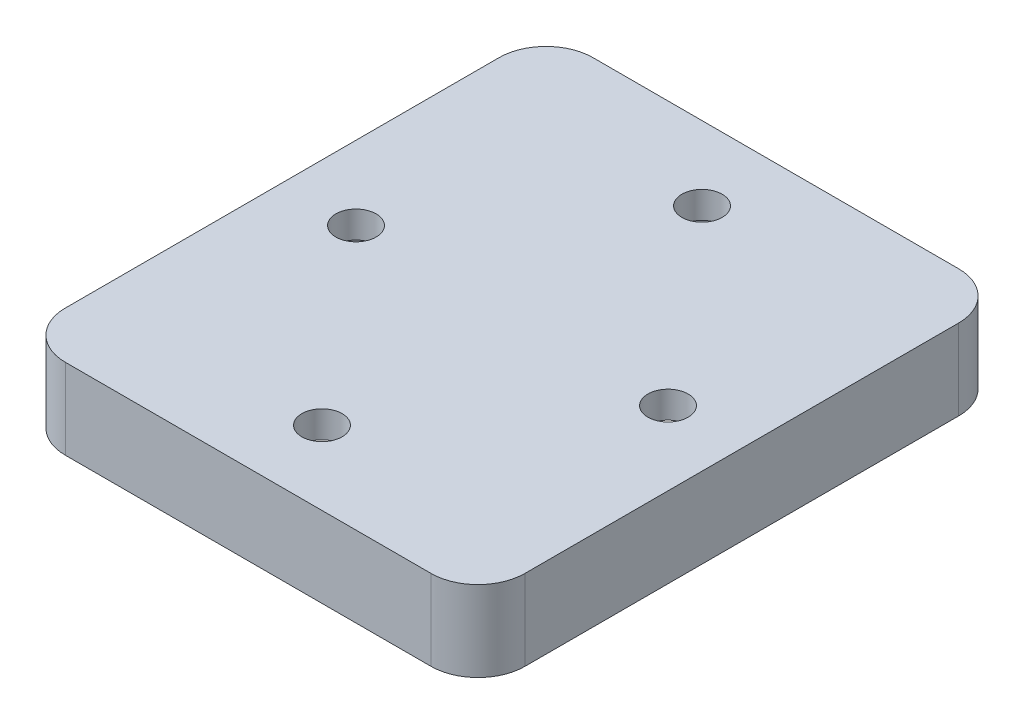
ISO-10303-21;
HEADER;
FILE_DESCRIPTION(('STEP AP214'),'2;1');
FILE_NAME('part.step','',(''),(''),'','','');
FILE_SCHEMA(('AUTOMOTIVE_DESIGN { 1 0 10303 214 1 1 1 1 }'));
ENDSEC;
DATA;
#1=APPLICATION_CONTEXT('core data for automotive mechanical design processes');
#2=APPLICATION_PROTOCOL_DEFINITION('international standard','automotive_design',2000,#1);
#3=PRODUCT_CONTEXT('',#1,'mechanical');
#4=PRODUCT('Part','Part','',(#3));
#5=PRODUCT_RELATED_PRODUCT_CATEGORY('part','',(#4));
#6=PRODUCT_DEFINITION_FORMATION('','',#4);
#7=PRODUCT_DEFINITION_CONTEXT('part definition',#1,'design');
#8=PRODUCT_DEFINITION('design','',#6,#7);
#9=PRODUCT_DEFINITION_SHAPE('','',#8);
#10=(LENGTH_UNIT() NAMED_UNIT(*) SI_UNIT(.MILLI.,.METRE.));
#11=(NAMED_UNIT(*) PLANE_ANGLE_UNIT() SI_UNIT($,.RADIAN.));
#12=(NAMED_UNIT(*) SI_UNIT($,.STERADIAN.) SOLID_ANGLE_UNIT());
#13=UNCERTAINTY_MEASURE_WITH_UNIT(LENGTH_MEASURE(1.E-05),#10,'distance_accuracy_value','');
#14=(GEOMETRIC_REPRESENTATION_CONTEXT(3) GLOBAL_UNCERTAINTY_ASSIGNED_CONTEXT((#13)) GLOBAL_UNIT_ASSIGNED_CONTEXT((#10,
#11,#12)) REPRESENTATION_CONTEXT('',''));
#15=CARTESIAN_POINT('',(0.,0.,0.));
#16=DIRECTION('',(0.,0.,1.));
#17=DIRECTION('',(1.,0.,0.));
#18=AXIS2_PLACEMENT_3D('',#15,#16,#17);
#19=CARTESIAN_POINT('',(-0.273367395030532,2.,-14.0233163024847));
#20=DIRECTION('',(0.,-1.,0.));
#21=DIRECTION('',(0.,0.,-1.));
#22=AXIS2_PLACEMENT_3D('',#19,#20,#21);
#23=CYLINDRICAL_SURFACE('',#22,1.5);
#24=CARTESIAN_POINT('',(-0.273367395030532,2.,-14.0233163024847));
#25=DIRECTION('',(0.,1.,0.));
#26=DIRECTION('',(0.,0.,1.));
#27=AXIS2_PLACEMENT_3D('',#24,#25,#26);
#28=CIRCLE('',#27,1.5);
#29=CARTESIAN_POINT('',(-0.273367395030532,2.,-12.5233163024847));
#30=VERTEX_POINT('',#29);
#31=EDGE_CURVE('E329',#30,#30,#28,.T.);
#32=ORIENTED_EDGE('',*,*,#31,.T.);
#33=EDGE_LOOP('',(#32));
#34=FACE_BOUND('',#33,.T.);
#35=CARTESIAN_POINT('',(-0.273367395030532,0.,-14.0233163024847));
#36=DIRECTION('',(0.,1.,0.));
#37=DIRECTION('',(0.,0.,1.));
#38=AXIS2_PLACEMENT_3D('',#35,#36,#37);
#39=CIRCLE('',#38,1.5);
#40=CARTESIAN_POINT('',(-0.273367395030532,0.,-12.5233163024847));
#41=VERTEX_POINT('',#40);
#42=EDGE_CURVE('E344',#41,#41,#39,.T.);
#43=ORIENTED_EDGE('',*,*,#42,.F.);
#44=EDGE_LOOP('',(#43));
#45=FACE_BOUND('',#44,.T.);
#46=ADVANCED_FACE('F41',(#34,#45),#23,.F.);
#47=CARTESIAN_POINT('',(-11.8983673950305,2.,0.136683697515252));
#48=DIRECTION('',(0.,-1.,0.));
#49=DIRECTION('',(0.,0.,-1.));
#50=AXIS2_PLACEMENT_3D('',#47,#48,#49);
#51=CYLINDRICAL_SURFACE('',#50,1.5);
#52=CARTESIAN_POINT('',(-11.8983673950305,2.,0.136683697515252));
#53=DIRECTION('',(0.,1.,0.));
#54=DIRECTION('',(0.,0.,1.));
#55=AXIS2_PLACEMENT_3D('',#52,#53,#54);
#56=CIRCLE('',#55,1.5);
#57=CARTESIAN_POINT('',(-11.8983673950305,2.,1.63668369751525));
#58=VERTEX_POINT('',#57);
#59=EDGE_CURVE('E325',#58,#58,#56,.T.);
#60=ORIENTED_EDGE('',*,*,#59,.T.);
#61=EDGE_LOOP('',(#60));
#62=FACE_BOUND('',#61,.T.);
#63=CARTESIAN_POINT('',(-11.8983673950305,0.,0.136683697515252));
#64=DIRECTION('',(0.,1.,0.));
#65=DIRECTION('',(0.,0.,1.));
#66=AXIS2_PLACEMENT_3D('',#63,#64,#65);
#67=CIRCLE('',#66,1.5);
#68=CARTESIAN_POINT('',(-11.8983673950305,0.,1.63668369751525));
#69=VERTEX_POINT('',#68);
#70=EDGE_CURVE('E340',#69,#69,#67,.T.);
#71=ORIENTED_EDGE('',*,*,#70,.F.);
#72=EDGE_LOOP('',(#71));
#73=FACE_BOUND('',#72,.T.);
#74=ADVANCED_FACE('F388',(#62,#73),#51,.F.);
#75=CARTESIAN_POINT('',(-0.273367395030534,2.,14.2966836975153));
#76=DIRECTION('',(0.,-1.,0.));
#77=DIRECTION('',(0.,0.,-1.));
#78=AXIS2_PLACEMENT_3D('',#75,#76,#77);
#79=CYLINDRICAL_SURFACE('',#78,1.5);
#80=CARTESIAN_POINT('',(-0.273367395030534,2.,14.2966836975153));
#81=DIRECTION('',(0.,1.,0.));
#82=DIRECTION('',(0.,0.,1.));
#83=AXIS2_PLACEMENT_3D('',#80,#81,#82);
#84=CIRCLE('',#83,1.5);
#85=CARTESIAN_POINT('',(-0.273367395030534,2.,15.7966836975153));
#86=VERTEX_POINT('',#85);
#87=EDGE_CURVE('E320',#86,#86,#84,.T.);
#88=ORIENTED_EDGE('',*,*,#87,.T.);
#89=EDGE_LOOP('',(#88));
#90=FACE_BOUND('',#89,.T.);
#91=CARTESIAN_POINT('',(-0.273367395030534,0.,14.2966836975153));
#92=DIRECTION('',(0.,1.,0.));
#93=DIRECTION('',(0.,0.,1.));
#94=AXIS2_PLACEMENT_3D('',#91,#92,#93);
#95=CIRCLE('',#94,1.5);
#96=CARTESIAN_POINT('',(-0.273367395030534,0.,15.7966836975153));
#97=VERTEX_POINT('',#96);
#98=EDGE_CURVE('E336',#97,#97,#95,.T.);
#99=ORIENTED_EDGE('',*,*,#98,.F.);
#100=EDGE_LOOP('',(#99));
#101=FACE_BOUND('',#100,.T.);
#102=ADVANCED_FACE('F394',(#90,#101),#79,.F.);
#103=CARTESIAN_POINT('',(11.3516326049695,2.,0.136683697515252));
#104=DIRECTION('',(0.,-1.,0.));
#105=DIRECTION('',(0.,0.,-1.));
#106=AXIS2_PLACEMENT_3D('',#103,#104,#105);
#107=CYLINDRICAL_SURFACE('',#106,1.5);
#108=CARTESIAN_POINT('',(11.3516326049695,2.,0.136683697515252));
#109=DIRECTION('',(0.,1.,0.));
#110=DIRECTION('',(0.,0.,1.));
#111=AXIS2_PLACEMENT_3D('',#108,#109,#110);
#112=CIRCLE('',#111,1.5);
#113=CARTESIAN_POINT('',(11.3516326049695,2.,1.63668369751525));
#114=VERTEX_POINT('',#113);
#115=EDGE_CURVE('E316',#114,#114,#112,.T.);
#116=ORIENTED_EDGE('',*,*,#115,.T.);
#117=EDGE_LOOP('',(#116));
#118=FACE_BOUND('',#117,.T.);
#119=CARTESIAN_POINT('',(11.3516326049695,0.,0.136683697515252));
#120=DIRECTION('',(0.,1.,0.));
#121=DIRECTION('',(0.,0.,1.));
#122=AXIS2_PLACEMENT_3D('',#119,#120,#121);
#123=CIRCLE('',#122,1.5);
#124=CARTESIAN_POINT('',(11.3516326049695,0.,1.63668369751525));
#125=VERTEX_POINT('',#124);
#126=EDGE_CURVE('E295',#125,#125,#123,.T.);
#127=ORIENTED_EDGE('',*,*,#126,.F.);
#128=EDGE_LOOP('',(#127));
#129=FACE_BOUND('',#128,.T.);
#130=ADVANCED_FACE('F43',(#118,#129),#107,.F.);
#131=CARTESIAN_POINT('',(0.,2.,0.));
#132=DIRECTION('',(0.,1.,0.));
#133=DIRECTION('',(0.,0.,1.));
#134=AXIS2_PLACEMENT_3D('',#131,#132,#133);
#135=PLANE('',#134);
#136=ORIENTED_EDGE('',*,*,#115,.F.);
#137=EDGE_LOOP('',(#136));
#138=FACE_BOUND('',#137,.T.);
#139=ORIENTED_EDGE('',*,*,#87,.F.);
#140=EDGE_LOOP('',(#139));
#141=FACE_BOUND('',#140,.T.);
#142=ORIENTED_EDGE('',*,*,#59,.F.);
#143=EDGE_LOOP('',(#142));
#144=FACE_BOUND('',#143,.T.);
#145=ORIENTED_EDGE('',*,*,#31,.F.);
#146=EDGE_LOOP('',(#145));
#147=FACE_BOUND('',#146,.T.);
#148=CARTESIAN_POINT('',(13.3516326049695,2.,-16.0233163024847));
#149=DIRECTION('',(0.,1.,0.));
#150=DIRECTION('',(0.,0.,1.));
#151=AXIS2_PLACEMENT_3D('',#148,#149,#150);
#152=CIRCLE('',#151,3.5);
#153=CARTESIAN_POINT('',(16.8516326049695,2.,-16.0233163024847));
#154=VERTEX_POINT('',#153);
#155=CARTESIAN_POINT('',(13.3516326049695,2.,-19.5233163024848));
#156=VERTEX_POINT('',#155);
#157=EDGE_CURVE('E205',#154,#156,#152,.T.);
#158=ORIENTED_EDGE('',*,*,#157,.T.);
#159=DIRECTION('',(-1.,0.,0.));
#160=VECTOR('',#159,1.);
#161=CARTESIAN_POINT('',(13.3516326049695,2.,-19.5233163024848));
#162=LINE('',#161,#160);
#163=CARTESIAN_POINT('',(-13.8983673950305,2.,-19.5233163024848));
#164=VERTEX_POINT('',#163);
#165=EDGE_CURVE('E265',#156,#164,#162,.T.);
#166=ORIENTED_EDGE('',*,*,#165,.T.);
#167=CARTESIAN_POINT('',(-13.8983673950305,2.,-16.0233163024847));
#168=DIRECTION('',(0.,1.,0.));
#169=DIRECTION('',(0.,0.,1.));
#170=AXIS2_PLACEMENT_3D('',#167,#168,#169);
#171=CIRCLE('',#170,3.5);
#172=CARTESIAN_POINT('',(-17.3983673950305,2.,-16.0233163024847));
#173=VERTEX_POINT('',#172);
#174=EDGE_CURVE('E269',#164,#173,#171,.T.);
#175=ORIENTED_EDGE('',*,*,#174,.T.);
#176=DIRECTION('',(0.,0.,1.));
#177=VECTOR('',#176,1.);
#178=CARTESIAN_POINT('',(-17.3983673950305,2.,-16.0233163024847));
#179=LINE('',#178,#177);
#180=CARTESIAN_POINT('',(-17.3983673950305,2.,16.2966836975153));
#181=VERTEX_POINT('',#180);
#182=EDGE_CURVE('E273',#173,#181,#179,.T.);
#183=ORIENTED_EDGE('',*,*,#182,.T.);
#184=CARTESIAN_POINT('',(-13.8983673950305,2.,16.2966836975153));
#185=DIRECTION('',(0.,1.,0.));
#186=DIRECTION('',(0.,0.,1.));
#187=AXIS2_PLACEMENT_3D('',#184,#185,#186);
#188=CIRCLE('',#187,3.5);
#189=CARTESIAN_POINT('',(-13.8983673950305,2.,19.7966836975153));
#190=VERTEX_POINT('',#189);
#191=EDGE_CURVE('E277',#181,#190,#188,.T.);
#192=ORIENTED_EDGE('',*,*,#191,.T.);
#193=DIRECTION('',(1.,0.,0.));
#194=VECTOR('',#193,1.);
#195=CARTESIAN_POINT('',(-13.8983673950305,2.,19.7966836975153));
#196=LINE('',#195,#194);
#197=CARTESIAN_POINT('',(13.3516326049695,2.,19.7966836975153));
#198=VERTEX_POINT('',#197);
#199=EDGE_CURVE('E281',#190,#198,#196,.T.);
#200=ORIENTED_EDGE('',*,*,#199,.T.);
#201=CARTESIAN_POINT('',(13.3516326049695,2.,16.2966836975153));
#202=DIRECTION('',(0.,1.,0.));
#203=DIRECTION('',(0.,0.,1.));
#204=AXIS2_PLACEMENT_3D('',#201,#202,#203);
#205=CIRCLE('',#204,3.5);
#206=CARTESIAN_POINT('',(16.8516326049695,2.,16.2966836975153));
#207=VERTEX_POINT('',#206);
#208=EDGE_CURVE('E285',#198,#207,#205,.T.);
#209=ORIENTED_EDGE('',*,*,#208,.T.);
#210=DIRECTION('',(0.,0.,-1.));
#211=VECTOR('',#210,1.);
#212=CARTESIAN_POINT('',(16.8516326049695,2.,16.2966836975153));
#213=LINE('',#212,#211);
#214=EDGE_CURVE('E233',#207,#154,#213,.T.);
#215=ORIENTED_EDGE('',*,*,#214,.T.);
#216=EDGE_LOOP('',(#158,#166,#175,#183,#192,#200,#209,#215));
#217=FACE_BOUND('',#216,.T.);
#218=ADVANCED_FACE('F405',(#138,#141,#144,#147,#217),#135,.T.);
#219=CARTESIAN_POINT('',(0.,0.,0.));
#220=DIRECTION('',(0.,1.,0.));
#221=DIRECTION('',(0.,0.,1.));
#222=AXIS2_PLACEMENT_3D('',#219,#220,#221);
#223=PLANE('',#222);
#224=ORIENTED_EDGE('',*,*,#126,.T.);
#225=EDGE_LOOP('',(#224));
#226=FACE_BOUND('',#225,.T.);
#227=ORIENTED_EDGE('',*,*,#98,.T.);
#228=EDGE_LOOP('',(#227));
#229=FACE_BOUND('',#228,.T.);
#230=ORIENTED_EDGE('',*,*,#70,.T.);
#231=EDGE_LOOP('',(#230));
#232=FACE_BOUND('',#231,.T.);
#233=ORIENTED_EDGE('',*,*,#42,.T.);
#234=EDGE_LOOP('',(#233));
#235=FACE_BOUND('',#234,.T.);
#236=DIRECTION('',(0.,0.,1.));
#237=VECTOR('',#236,1.);
#238=CARTESIAN_POINT('',(-15.8983673950305,0.,0.));
#239=LINE('',#238,#237);
#240=CARTESIAN_POINT('',(-15.8983673950305,0.,-16.0233163024847));
#241=VERTEX_POINT('',#240);
#242=CARTESIAN_POINT('',(-15.8983673950305,0.,16.2966836975153));
#243=VERTEX_POINT('',#242);
#244=EDGE_CURVE('E354',#241,#243,#239,.T.);
#245=ORIENTED_EDGE('',*,*,#244,.F.);
#246=CARTESIAN_POINT('',(-13.8983673950305,0.,-16.0233163024847));
#247=DIRECTION('',(0.,1.,0.));
#248=DIRECTION('',(0.,0.,1.));
#249=AXIS2_PLACEMENT_3D('',#246,#247,#248);
#250=CIRCLE('',#249,2.);
#251=CARTESIAN_POINT('',(-13.8983673950305,0.,-18.0233163024848));
#252=VERTEX_POINT('',#251);
#253=EDGE_CURVE('E11',#241,#252,#250,.F.);
#254=ORIENTED_EDGE('',*,*,#253,.T.);
#255=DIRECTION('',(-1.,0.,0.));
#256=VECTOR('',#255,1.);
#257=CARTESIAN_POINT('',(0.,0.,-18.0233163024848));
#258=LINE('',#257,#256);
#259=CARTESIAN_POINT('',(13.3516326049695,0.,-18.0233163024848));
#260=VERTEX_POINT('',#259);
#261=EDGE_CURVE('E56',#260,#252,#258,.T.);
#262=ORIENTED_EDGE('',*,*,#261,.F.);
#263=CARTESIAN_POINT('',(13.3516326049695,0.,-16.0233163024847));
#264=DIRECTION('',(0.,1.,0.));
#265=DIRECTION('',(0.,0.,1.));
#266=AXIS2_PLACEMENT_3D('',#263,#264,#265);
#267=CIRCLE('',#266,2.);
#268=CARTESIAN_POINT('',(15.3516326049695,0.,-16.0233163024847));
#269=VERTEX_POINT('',#268);
#270=EDGE_CURVE('E160',#260,#269,#267,.F.);
#271=ORIENTED_EDGE('',*,*,#270,.T.);
#272=DIRECTION('',(0.,0.,-1.));
#273=VECTOR('',#272,1.);
#274=CARTESIAN_POINT('',(15.3516326049695,0.,0.));
#275=LINE('',#274,#273);
#276=CARTESIAN_POINT('',(15.3516326049695,0.,16.2966836975153));
#277=VERTEX_POINT('',#276);
#278=EDGE_CURVE('E348',#277,#269,#275,.T.);
#279=ORIENTED_EDGE('',*,*,#278,.F.);
#280=CARTESIAN_POINT('',(13.3516326049695,0.,16.2966836975153));
#281=DIRECTION('',(0.,1.,0.));
#282=DIRECTION('',(0.,0.,1.));
#283=AXIS2_PLACEMENT_3D('',#280,#281,#282);
#284=CIRCLE('',#283,2.);
#285=CARTESIAN_POINT('',(13.3516326049695,0.,18.2966836975153));
#286=VERTEX_POINT('',#285);
#287=EDGE_CURVE('E63',#277,#286,#284,.F.);
#288=ORIENTED_EDGE('',*,*,#287,.T.);
#289=DIRECTION('',(1.,0.,0.));
#290=VECTOR('',#289,1.);
#291=CARTESIAN_POINT('',(0.,0.,18.2966836975153));
#292=LINE('',#291,#290);
#293=CARTESIAN_POINT('',(-13.8983673950305,0.,18.2966836975153));
#294=VERTEX_POINT('',#293);
#295=EDGE_CURVE('E321',#294,#286,#292,.T.);
#296=ORIENTED_EDGE('',*,*,#295,.F.);
#297=CARTESIAN_POINT('',(-13.8983673950305,0.,16.2966836975153));
#298=DIRECTION('',(0.,1.,0.));
#299=DIRECTION('',(0.,0.,1.));
#300=AXIS2_PLACEMENT_3D('',#297,#298,#299);
#301=CIRCLE('',#300,2.);
#302=EDGE_CURVE('E50',#294,#243,#301,.F.);
#303=ORIENTED_EDGE('',*,*,#302,.T.);
#304=EDGE_LOOP('',(#245,#254,#262,#271,#279,#288,#296,#303));
#305=FACE_BOUND('',#304,.T.);
#306=ADVANCED_FACE('F365',(#226,#229,#232,#235,#305),#223,.F.);
#307=CARTESIAN_POINT('',(13.3516326049695,-4.,-16.0233163024847));
#308=DIRECTION('',(0.,1.,0.));
#309=DIRECTION('',(0.,0.,1.));
#310=AXIS2_PLACEMENT_3D('',#307,#308,#309);
#311=CYLINDRICAL_SURFACE('',#310,2.);
#312=DIRECTION('',(0.,1.,0.));
#313=VECTOR('',#312,1.);
#314=CARTESIAN_POINT('',(15.3516326049695,-4.,-16.0233163024847));
#315=LINE('',#314,#313);
#316=CARTESIAN_POINT('',(15.3516326049695,-4.,-16.0233163024847));
#317=VERTEX_POINT('',#316);
#318=EDGE_CURVE('E202',#317,#269,#315,.T.);
#319=ORIENTED_EDGE('',*,*,#318,.T.);
#320=ORIENTED_EDGE('',*,*,#270,.F.);
#321=DIRECTION('',(0.,1.,0.));
#322=VECTOR('',#321,1.);
#323=CARTESIAN_POINT('',(13.3516326049695,-4.,-18.0233163024848));
#324=LINE('',#323,#322);
#325=CARTESIAN_POINT('',(13.3516326049695,-4.,-18.0233163024848));
#326=VERTEX_POINT('',#325);
#327=EDGE_CURVE('E153',#326,#260,#324,.T.);
#328=ORIENTED_EDGE('',*,*,#327,.F.);
#329=CARTESIAN_POINT('',(13.3516326049695,-4.,-16.0233163024847));
#330=DIRECTION('',(0.,1.,0.));
#331=DIRECTION('',(0.,0.,1.));
#332=AXIS2_PLACEMENT_3D('',#329,#330,#331);
#333=CIRCLE('',#332,2.);
#334=EDGE_CURVE('E158',#317,#326,#333,.T.);
#335=ORIENTED_EDGE('',*,*,#334,.F.);
#336=EDGE_LOOP('',(#319,#320,#328,#335));
#337=FACE_BOUND('',#336,.T.);
#338=ADVANCED_FACE('F156',(#337),#311,.F.);
#339=CARTESIAN_POINT('',(13.3516326049695,-4.,16.2966836975153));
#340=DIRECTION('',(0.,1.,0.));
#341=DIRECTION('',(0.,0.,1.));
#342=AXIS2_PLACEMENT_3D('',#339,#340,#341);
#343=CYLINDRICAL_SURFACE('',#342,2.);
#344=DIRECTION('',(0.,1.,0.));
#345=VECTOR('',#344,1.);
#346=CARTESIAN_POINT('',(13.3516326049695,-4.,18.2966836975153));
#347=LINE('',#346,#345);
#348=CARTESIAN_POINT('',(13.3516326049695,-4.,18.2966836975153));
#349=VERTEX_POINT('',#348);
#350=EDGE_CURVE('E210',#349,#286,#347,.T.);
#351=ORIENTED_EDGE('',*,*,#350,.T.);
#352=ORIENTED_EDGE('',*,*,#287,.F.);
#353=DIRECTION('',(0.,1.,0.));
#354=VECTOR('',#353,1.);
#355=CARTESIAN_POINT('',(15.3516326049695,-4.,16.2966836975153));
#356=LINE('',#355,#354);
#357=CARTESIAN_POINT('',(15.3516326049695,-4.,16.2966836975153));
#358=VERTEX_POINT('',#357);
#359=EDGE_CURVE('E206',#358,#277,#356,.T.);
#360=ORIENTED_EDGE('',*,*,#359,.F.);
#361=CARTESIAN_POINT('',(13.3516326049695,-4.,16.2966836975153));
#362=DIRECTION('',(0.,1.,0.));
#363=DIRECTION('',(0.,0.,1.));
#364=AXIS2_PLACEMENT_3D('',#361,#362,#363);
#365=CIRCLE('',#364,2.);
#366=EDGE_CURVE('E197',#349,#358,#365,.T.);
#367=ORIENTED_EDGE('',*,*,#366,.F.);
#368=EDGE_LOOP('',(#351,#352,#360,#367));
#369=FACE_BOUND('',#368,.T.);
#370=ADVANCED_FACE('F384',(#369),#343,.F.);
#371=CARTESIAN_POINT('',(-13.8983673950305,-4.,16.2966836975153));
#372=DIRECTION('',(0.,1.,0.));
#373=DIRECTION('',(0.,0.,1.));
#374=AXIS2_PLACEMENT_3D('',#371,#372,#373);
#375=CYLINDRICAL_SURFACE('',#374,2.);
#376=DIRECTION('',(0.,1.,0.));
#377=VECTOR('',#376,1.);
#378=CARTESIAN_POINT('',(-15.8983673950305,-4.,16.2966836975153));
#379=LINE('',#378,#377);
#380=CARTESIAN_POINT('',(-15.8983673950305,-4.,16.2966836975153));
#381=VERTEX_POINT('',#380);
#382=EDGE_CURVE('E218',#381,#243,#379,.T.);
#383=ORIENTED_EDGE('',*,*,#382,.T.);
#384=ORIENTED_EDGE('',*,*,#302,.F.);
#385=DIRECTION('',(0.,1.,0.));
#386=VECTOR('',#385,1.);
#387=CARTESIAN_POINT('',(-13.8983673950305,-4.,18.2966836975153));
#388=LINE('',#387,#386);
#389=CARTESIAN_POINT('',(-13.8983673950305,-4.,18.2966836975153));
#390=VERTEX_POINT('',#389);
#391=EDGE_CURVE('E214',#390,#294,#388,.T.);
#392=ORIENTED_EDGE('',*,*,#391,.F.);
#393=CARTESIAN_POINT('',(-13.8983673950305,-4.,16.2966836975153));
#394=DIRECTION('',(0.,1.,0.));
#395=DIRECTION('',(0.,0.,1.));
#396=AXIS2_PLACEMENT_3D('',#393,#394,#395);
#397=CIRCLE('',#396,2.);
#398=EDGE_CURVE('E189',#381,#390,#397,.T.);
#399=ORIENTED_EDGE('',*,*,#398,.F.);
#400=EDGE_LOOP('',(#383,#384,#392,#399));
#401=FACE_BOUND('',#400,.T.);
#402=ADVANCED_FACE('F372',(#401),#375,.F.);
#403=CARTESIAN_POINT('',(-13.8983673950305,-4.,-16.0233163024847));
#404=DIRECTION('',(0.,1.,0.));
#405=DIRECTION('',(0.,0.,1.));
#406=AXIS2_PLACEMENT_3D('',#403,#404,#405);
#407=CYLINDRICAL_SURFACE('',#406,2.);
#408=DIRECTION('',(0.,1.,0.));
#409=VECTOR('',#408,1.);
#410=CARTESIAN_POINT('',(-13.8983673950305,-4.,-18.0233163024848));
#411=LINE('',#410,#409);
#412=CARTESIAN_POINT('',(-13.8983673950305,-4.,-18.0233163024848));
#413=VERTEX_POINT('',#412);
#414=EDGE_CURVE('E163',#413,#252,#411,.T.);
#415=ORIENTED_EDGE('',*,*,#414,.T.);
#416=ORIENTED_EDGE('',*,*,#253,.F.);
#417=DIRECTION('',(0.,1.,0.));
#418=VECTOR('',#417,1.);
#419=CARTESIAN_POINT('',(-15.8983673950305,-4.,-16.0233163024847));
#420=LINE('',#419,#418);
#421=CARTESIAN_POINT('',(-15.8983673950305,-4.,-16.0233163024847));
#422=VERTEX_POINT('',#421);
#423=EDGE_CURVE('E222',#422,#241,#420,.T.);
#424=ORIENTED_EDGE('',*,*,#423,.F.);
#425=CARTESIAN_POINT('',(-13.8983673950305,-4.,-16.0233163024847));
#426=DIRECTION('',(0.,1.,0.));
#427=DIRECTION('',(0.,0.,1.));
#428=AXIS2_PLACEMENT_3D('',#425,#426,#427);
#429=CIRCLE('',#428,2.);
#430=EDGE_CURVE('E174',#413,#422,#429,.T.);
#431=ORIENTED_EDGE('',*,*,#430,.F.);
#432=EDGE_LOOP('',(#415,#416,#424,#431));
#433=FACE_BOUND('',#432,.T.);
#434=ADVANCED_FACE('F375',(#433),#407,.F.);
#435=CARTESIAN_POINT('',(-15.8983673950305,-4.,-16.0233163024847));
#436=DIRECTION('',(-1.,0.,0.));
#437=DIRECTION('',(0.,0.,1.));
#438=AXIS2_PLACEMENT_3D('',#435,#436,#437);
#439=PLANE('',#438);
#440=ORIENTED_EDGE('',*,*,#423,.T.);
#441=ORIENTED_EDGE('',*,*,#244,.T.);
#442=ORIENTED_EDGE('',*,*,#382,.F.);
#443=DIRECTION('',(0.,0.,1.));
#444=VECTOR('',#443,1.);
#445=CARTESIAN_POINT('',(-15.8983673950305,-4.,-16.0233163024847));
#446=LINE('',#445,#444);
#447=EDGE_CURVE('E185',#422,#381,#446,.T.);
#448=ORIENTED_EDGE('',*,*,#447,.F.);
#449=EDGE_LOOP('',(#440,#441,#442,#448));
#450=FACE_BOUND('',#449,.T.);
#451=ADVANCED_FACE('F369',(#450),#439,.F.);
#452=CARTESIAN_POINT('',(-13.8983673950305,-4.,18.2966836975153));
#453=DIRECTION('',(0.,0.,1.));
#454=DIRECTION('',(1.,0.,0.));
#455=AXIS2_PLACEMENT_3D('',#452,#453,#454);
#456=PLANE('',#455);
#457=ORIENTED_EDGE('',*,*,#391,.T.);
#458=ORIENTED_EDGE('',*,*,#295,.T.);
#459=ORIENTED_EDGE('',*,*,#350,.F.);
#460=DIRECTION('',(1.,0.,0.));
#461=VECTOR('',#460,1.);
#462=CARTESIAN_POINT('',(-13.8983673950305,-4.,18.2966836975153));
#463=LINE('',#462,#461);
#464=EDGE_CURVE('E193',#390,#349,#463,.T.);
#465=ORIENTED_EDGE('',*,*,#464,.F.);
#466=EDGE_LOOP('',(#457,#458,#459,#465));
#467=FACE_BOUND('',#466,.T.);
#468=ADVANCED_FACE('F382',(#467),#456,.F.);
#469=CARTESIAN_POINT('',(15.3516326049695,-4.,16.2966836975153));
#470=DIRECTION('',(1.,0.,0.));
#471=DIRECTION('',(0.,0.,-1.));
#472=AXIS2_PLACEMENT_3D('',#469,#470,#471);
#473=PLANE('',#472);
#474=ORIENTED_EDGE('',*,*,#359,.T.);
#475=ORIENTED_EDGE('',*,*,#278,.T.);
#476=ORIENTED_EDGE('',*,*,#318,.F.);
#477=DIRECTION('',(0.,0.,-1.));
#478=VECTOR('',#477,1.);
#479=CARTESIAN_POINT('',(15.3516326049695,-4.,16.2966836975153));
#480=LINE('',#479,#478);
#481=EDGE_CURVE('E164',#358,#317,#480,.T.);
#482=ORIENTED_EDGE('',*,*,#481,.F.);
#483=EDGE_LOOP('',(#474,#475,#476,#482));
#484=FACE_BOUND('',#483,.T.);
#485=ADVANCED_FACE('F465',(#484),#473,.F.);
#486=CARTESIAN_POINT('',(13.3516326049695,-4.,-18.0233163024848));
#487=DIRECTION('',(0.,0.,-1.));
#488=DIRECTION('',(-1.,0.,0.));
#489=AXIS2_PLACEMENT_3D('',#486,#487,#488);
#490=PLANE('',#489);
#491=ORIENTED_EDGE('',*,*,#327,.T.);
#492=ORIENTED_EDGE('',*,*,#261,.T.);
#493=ORIENTED_EDGE('',*,*,#414,.F.);
#494=DIRECTION('',(-1.,0.,0.));
#495=VECTOR('',#494,1.);
#496=CARTESIAN_POINT('',(13.3516326049695,-4.,-18.0233163024848));
#497=LINE('',#496,#495);
#498=EDGE_CURVE('E168',#326,#413,#497,.T.);
#499=ORIENTED_EDGE('',*,*,#498,.F.);
#500=EDGE_LOOP('',(#491,#492,#493,#499));
#501=FACE_BOUND('',#500,.T.);
#502=ADVANCED_FACE('F169',(#501),#490,.F.);
#503=CARTESIAN_POINT('',(13.3516326049695,-4.,-16.0233163024847));
#504=DIRECTION('',(0.,1.,0.));
#505=DIRECTION('',(0.,0.,1.));
#506=AXIS2_PLACEMENT_3D('',#503,#504,#505);
#507=CYLINDRICAL_SURFACE('',#506,3.5);
#508=ORIENTED_EDGE('',*,*,#157,.F.);
#509=DIRECTION('',(0.,1.,0.));
#510=VECTOR('',#509,1.);
#511=CARTESIAN_POINT('',(16.8516326049695,-4.,-16.0233163024847));
#512=LINE('',#511,#510);
#513=CARTESIAN_POINT('',(16.8516326049695,-4.,-16.0233163024847));
#514=VERTEX_POINT('',#513);
#515=EDGE_CURVE('E292',#514,#154,#512,.T.);
#516=ORIENTED_EDGE('',*,*,#515,.F.);
#517=CARTESIAN_POINT('',(13.3516326049695,-4.,-16.0233163024847));
#518=DIRECTION('',(0.,1.,0.));
#519=DIRECTION('',(0.,0.,1.));
#520=AXIS2_PLACEMENT_3D('',#517,#518,#519);
#521=CIRCLE('',#520,3.5);
#522=CARTESIAN_POINT('',(13.3516326049695,-4.,-19.5233163024848));
#523=VERTEX_POINT('',#522);
#524=EDGE_CURVE('E228',#514,#523,#521,.T.);
#525=ORIENTED_EDGE('',*,*,#524,.T.);
#526=DIRECTION('',(0.,1.,0.));
#527=VECTOR('',#526,1.);
#528=CARTESIAN_POINT('',(13.3516326049695,-4.,-19.5233163024848));
#529=LINE('',#528,#527);
#530=EDGE_CURVE('E261',#523,#156,#529,.T.);
#531=ORIENTED_EDGE('',*,*,#530,.T.);
#532=EDGE_LOOP('',(#508,#516,#525,#531));
#533=FACE_BOUND('',#532,.T.);
#534=ADVANCED_FACE('F431',(#533),#507,.T.);
#535=CARTESIAN_POINT('',(16.8516326049695,-4.,16.2966836975153));
#536=DIRECTION('',(1.,0.,0.));
#537=DIRECTION('',(0.,0.,-1.));
#538=AXIS2_PLACEMENT_3D('',#535,#536,#537);
#539=PLANE('',#538);
#540=ORIENTED_EDGE('',*,*,#214,.F.);
#541=DIRECTION('',(0.,1.,0.));
#542=VECTOR('',#541,1.);
#543=CARTESIAN_POINT('',(16.8516326049695,-4.,16.2966836975153));
#544=LINE('',#543,#542);
#545=CARTESIAN_POINT('',(16.8516326049695,-4.,16.2966836975153));
#546=VERTEX_POINT('',#545);
#547=EDGE_CURVE('E296',#546,#207,#544,.T.);
#548=ORIENTED_EDGE('',*,*,#547,.F.);
#549=DIRECTION('',(0.,0.,-1.));
#550=VECTOR('',#549,1.);
#551=CARTESIAN_POINT('',(16.8516326049695,-4.,16.2966836975153));
#552=LINE('',#551,#550);
#553=EDGE_CURVE('E257',#546,#514,#552,.T.);
#554=ORIENTED_EDGE('',*,*,#553,.T.);
#555=ORIENTED_EDGE('',*,*,#515,.T.);
#556=EDGE_LOOP('',(#540,#548,#554,#555));
#557=FACE_BOUND('',#556,.T.);
#558=ADVANCED_FACE('F434',(#557),#539,.T.);
#559=CARTESIAN_POINT('',(13.3516326049695,-4.,16.2966836975153));
#560=DIRECTION('',(0.,1.,0.));
#561=DIRECTION('',(0.,0.,1.));
#562=AXIS2_PLACEMENT_3D('',#559,#560,#561);
#563=CYLINDRICAL_SURFACE('',#562,3.5);
#564=ORIENTED_EDGE('',*,*,#208,.F.);
#565=DIRECTION('',(0.,1.,0.));
#566=VECTOR('',#565,1.);
#567=CARTESIAN_POINT('',(13.3516326049695,-4.,19.7966836975153));
#568=LINE('',#567,#566);
#569=CARTESIAN_POINT('',(13.3516326049695,-4.,19.7966836975153));
#570=VERTEX_POINT('',#569);
#571=EDGE_CURVE('E299',#570,#198,#568,.T.);
#572=ORIENTED_EDGE('',*,*,#571,.F.);
#573=CARTESIAN_POINT('',(13.3516326049695,-4.,16.2966836975153));
#574=DIRECTION('',(0.,1.,0.));
#575=DIRECTION('',(0.,0.,1.));
#576=AXIS2_PLACEMENT_3D('',#573,#574,#575);
#577=CIRCLE('',#576,3.5);
#578=EDGE_CURVE('E253',#570,#546,#577,.T.);
#579=ORIENTED_EDGE('',*,*,#578,.T.);
#580=ORIENTED_EDGE('',*,*,#547,.T.);
#581=EDGE_LOOP('',(#564,#572,#579,#580));
#582=FACE_BOUND('',#581,.T.);
#583=ADVANCED_FACE('F455',(#582),#563,.T.);
#584=CARTESIAN_POINT('',(-13.8983673950305,-4.,19.7966836975153));
#585=DIRECTION('',(0.,0.,1.));
#586=DIRECTION('',(1.,0.,0.));
#587=AXIS2_PLACEMENT_3D('',#584,#585,#586);
#588=PLANE('',#587);
#589=ORIENTED_EDGE('',*,*,#199,.F.);
#590=DIRECTION('',(0.,1.,0.));
#591=VECTOR('',#590,1.);
#592=CARTESIAN_POINT('',(-13.8983673950305,-4.,19.7966836975153));
#593=LINE('',#592,#591);
#594=CARTESIAN_POINT('',(-13.8983673950305,-4.,19.7966836975153));
#595=VERTEX_POINT('',#594);
#596=EDGE_CURVE('E302',#595,#190,#593,.T.);
#597=ORIENTED_EDGE('',*,*,#596,.F.);
#598=DIRECTION('',(1.,0.,0.));
#599=VECTOR('',#598,1.);
#600=CARTESIAN_POINT('',(-13.8983673950305,-4.,19.7966836975153));
#601=LINE('',#600,#599);
#602=EDGE_CURVE('E249',#595,#570,#601,.T.);
#603=ORIENTED_EDGE('',*,*,#602,.T.);
#604=ORIENTED_EDGE('',*,*,#571,.T.);
#605=EDGE_LOOP('',(#589,#597,#603,#604));
#606=FACE_BOUND('',#605,.T.);
#607=ADVANCED_FACE('F451',(#606),#588,.T.);
#608=CARTESIAN_POINT('',(-13.8983673950305,-4.,16.2966836975153));
#609=DIRECTION('',(0.,1.,0.));
#610=DIRECTION('',(0.,0.,1.));
#611=AXIS2_PLACEMENT_3D('',#608,#609,#610);
#612=CYLINDRICAL_SURFACE('',#611,3.5);
#613=ORIENTED_EDGE('',*,*,#191,.F.);
#614=DIRECTION('',(0.,1.,0.));
#615=VECTOR('',#614,1.);
#616=CARTESIAN_POINT('',(-17.3983673950305,-4.,16.2966836975153));
#617=LINE('',#616,#615);
#618=CARTESIAN_POINT('',(-17.3983673950305,-4.,16.2966836975153));
#619=VERTEX_POINT('',#618);
#620=EDGE_CURVE('E305',#619,#181,#617,.T.);
#621=ORIENTED_EDGE('',*,*,#620,.F.);
#622=CARTESIAN_POINT('',(-13.8983673950305,-4.,16.2966836975153));
#623=DIRECTION('',(0.,1.,0.));
#624=DIRECTION('',(0.,0.,1.));
#625=AXIS2_PLACEMENT_3D('',#622,#623,#624);
#626=CIRCLE('',#625,3.5);
#627=EDGE_CURVE('E245',#619,#595,#626,.T.);
#628=ORIENTED_EDGE('',*,*,#627,.T.);
#629=ORIENTED_EDGE('',*,*,#596,.T.);
#630=EDGE_LOOP('',(#613,#621,#628,#629));
#631=FACE_BOUND('',#630,.T.);
#632=ADVANCED_FACE('F447',(#631),#612,.T.);
#633=CARTESIAN_POINT('',(-17.3983673950305,-4.,-16.0233163024847));
#634=DIRECTION('',(-1.,0.,0.));
#635=DIRECTION('',(0.,0.,1.));
#636=AXIS2_PLACEMENT_3D('',#633,#634,#635);
#637=PLANE('',#636);
#638=ORIENTED_EDGE('',*,*,#182,.F.);
#639=DIRECTION('',(0.,1.,0.));
#640=VECTOR('',#639,1.);
#641=CARTESIAN_POINT('',(-17.3983673950305,-4.,-16.0233163024847));
#642=LINE('',#641,#640);
#643=CARTESIAN_POINT('',(-17.3983673950305,-4.,-16.0233163024847));
#644=VERTEX_POINT('',#643);
#645=EDGE_CURVE('E308',#644,#173,#642,.T.);
#646=ORIENTED_EDGE('',*,*,#645,.F.);
#647=DIRECTION('',(0.,0.,1.));
#648=VECTOR('',#647,1.);
#649=CARTESIAN_POINT('',(-17.3983673950305,-4.,-16.0233163024847));
#650=LINE('',#649,#648);
#651=EDGE_CURVE('E241',#644,#619,#650,.T.);
#652=ORIENTED_EDGE('',*,*,#651,.T.);
#653=ORIENTED_EDGE('',*,*,#620,.T.);
#654=EDGE_LOOP('',(#638,#646,#652,#653));
#655=FACE_BOUND('',#654,.T.);
#656=ADVANCED_FACE('F443',(#655),#637,.T.);
#657=CARTESIAN_POINT('',(-13.8983673950305,-4.,-16.0233163024847));
#658=DIRECTION('',(0.,1.,0.));
#659=DIRECTION('',(0.,0.,1.));
#660=AXIS2_PLACEMENT_3D('',#657,#658,#659);
#661=CYLINDRICAL_SURFACE('',#660,3.5);
#662=ORIENTED_EDGE('',*,*,#174,.F.);
#663=DIRECTION('',(0.,1.,0.));
#664=VECTOR('',#663,1.);
#665=CARTESIAN_POINT('',(-13.8983673950305,-4.,-19.5233163024848));
#666=LINE('',#665,#664);
#667=CARTESIAN_POINT('',(-13.8983673950305,-4.,-19.5233163024848));
#668=VERTEX_POINT('',#667);
#669=EDGE_CURVE('E311',#668,#164,#666,.T.);
#670=ORIENTED_EDGE('',*,*,#669,.F.);
#671=CARTESIAN_POINT('',(-13.8983673950305,-4.,-16.0233163024847));
#672=DIRECTION('',(0.,1.,0.));
#673=DIRECTION('',(0.,0.,1.));
#674=AXIS2_PLACEMENT_3D('',#671,#672,#673);
#675=CIRCLE('',#674,3.5);
#676=EDGE_CURVE('E237',#668,#644,#675,.T.);
#677=ORIENTED_EDGE('',*,*,#676,.T.);
#678=ORIENTED_EDGE('',*,*,#645,.T.);
#679=EDGE_LOOP('',(#662,#670,#677,#678));
#680=FACE_BOUND('',#679,.T.);
#681=ADVANCED_FACE('F439',(#680),#661,.T.);
#682=CARTESIAN_POINT('',(13.3516326049695,-4.,-19.5233163024848));
#683=DIRECTION('',(0.,0.,-1.));
#684=DIRECTION('',(-1.,0.,0.));
#685=AXIS2_PLACEMENT_3D('',#682,#683,#684);
#686=PLANE('',#685);
#687=ORIENTED_EDGE('',*,*,#165,.F.);
#688=ORIENTED_EDGE('',*,*,#530,.F.);
#689=DIRECTION('',(-1.,0.,0.));
#690=VECTOR('',#689,1.);
#691=CARTESIAN_POINT('',(13.3516326049695,-4.,-19.5233163024848));
#692=LINE('',#691,#690);
#693=EDGE_CURVE('E232',#523,#668,#692,.T.);
#694=ORIENTED_EDGE('',*,*,#693,.T.);
#695=ORIENTED_EDGE('',*,*,#669,.T.);
#696=EDGE_LOOP('',(#687,#688,#694,#695));
#697=FACE_BOUND('',#696,.T.);
#698=ADVANCED_FACE('F436',(#697),#686,.T.);
#699=CARTESIAN_POINT('',(13.3516326049695,-4.,-16.0233163024847));
#700=DIRECTION('',(0.,1.,0.));
#701=DIRECTION('',(0.,0.,1.));
#702=AXIS2_PLACEMENT_3D('',#699,#700,#701);
#703=PLANE('',#702);
#704=ORIENTED_EDGE('',*,*,#481,.T.);
#705=ORIENTED_EDGE('',*,*,#334,.T.);
#706=ORIENTED_EDGE('',*,*,#498,.T.);
#707=ORIENTED_EDGE('',*,*,#430,.T.);
#708=ORIENTED_EDGE('',*,*,#447,.T.);
#709=ORIENTED_EDGE('',*,*,#398,.T.);
#710=ORIENTED_EDGE('',*,*,#464,.T.);
#711=ORIENTED_EDGE('',*,*,#366,.T.);
#712=EDGE_LOOP('',(#704,#705,#706,#707,#708,#709,#710,#711));
#713=FACE_BOUND('',#712,.T.);
#714=ORIENTED_EDGE('',*,*,#524,.F.);
#715=ORIENTED_EDGE('',*,*,#553,.F.);
#716=ORIENTED_EDGE('',*,*,#578,.F.);
#717=ORIENTED_EDGE('',*,*,#602,.F.);
#718=ORIENTED_EDGE('',*,*,#627,.F.);
#719=ORIENTED_EDGE('',*,*,#651,.F.);
#720=ORIENTED_EDGE('',*,*,#676,.F.);
#721=ORIENTED_EDGE('',*,*,#693,.F.);
#722=EDGE_LOOP('',(#714,#715,#716,#717,#718,#719,#720,#721));
#723=FACE_BOUND('',#722,.T.);
#724=ADVANCED_FACE('F176',(#713,#723),#703,.F.);
#725=CLOSED_SHELL('',(#46,#74,#102,#130,#218,#306,#338,#370,#402,#434,#451,#468,#485,#502,#534,
#558,#583,#607,#632,#656,#681,#698,#724));
#726=MANIFOLD_SOLID_BREP('B2',#725);
#727=ADVANCED_BREP_SHAPE_REPRESENTATION('',(#18,#726),#14);
#728=SHAPE_DEFINITION_REPRESENTATION(#9,#727);
ENDSEC;
END-ISO-10303-21;
